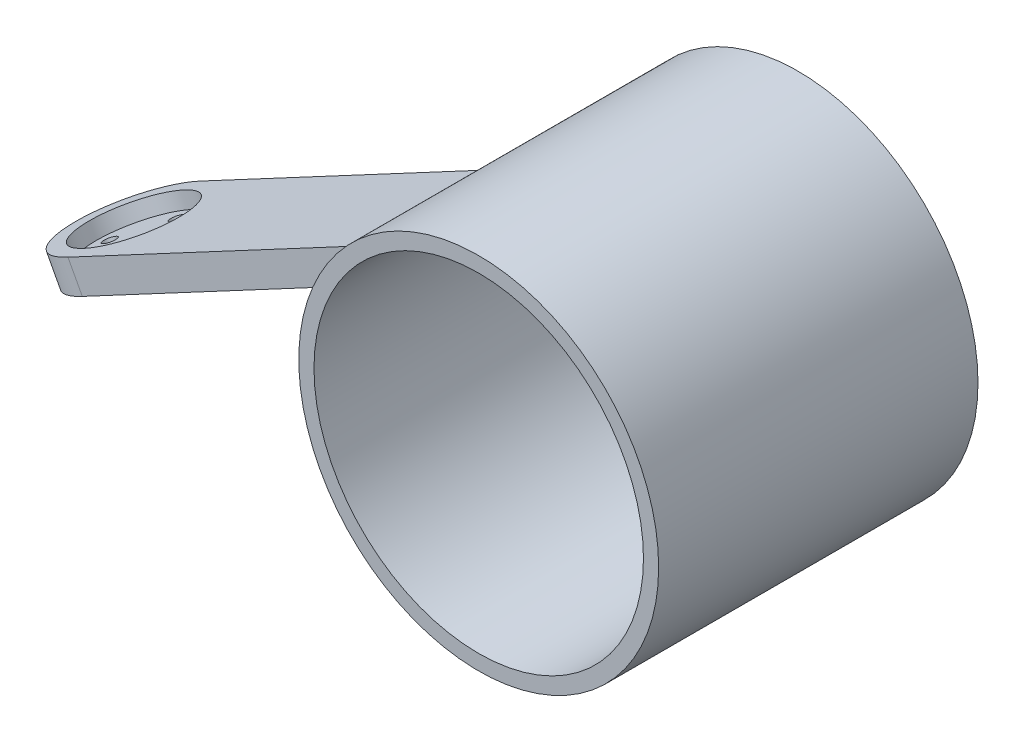
ISO-10303-21;
HEADER;
FILE_DESCRIPTION(('STEP AP214'),'2;1');
FILE_NAME('part.step','',(''),(''),'','','');
FILE_SCHEMA(('AUTOMOTIVE_DESIGN { 1 0 10303 214 1 1 1 1 }'));
ENDSEC;
DATA;
#1=APPLICATION_CONTEXT('core data for automotive mechanical design processes');
#2=APPLICATION_PROTOCOL_DEFINITION('international standard','automotive_design',2000,#1);
#3=PRODUCT_CONTEXT('',#1,'mechanical');
#4=PRODUCT('Part','Part','',(#3));
#5=PRODUCT_RELATED_PRODUCT_CATEGORY('part','',(#4));
#6=PRODUCT_DEFINITION_FORMATION('','',#4);
#7=PRODUCT_DEFINITION_CONTEXT('part definition',#1,'design');
#8=PRODUCT_DEFINITION('design','',#6,#7);
#9=PRODUCT_DEFINITION_SHAPE('','',#8);
#10=(LENGTH_UNIT() NAMED_UNIT(*) SI_UNIT(.MILLI.,.METRE.));
#11=(NAMED_UNIT(*) PLANE_ANGLE_UNIT() SI_UNIT($,.RADIAN.));
#12=(NAMED_UNIT(*) SI_UNIT($,.STERADIAN.) SOLID_ANGLE_UNIT());
#13=UNCERTAINTY_MEASURE_WITH_UNIT(LENGTH_MEASURE(1.E-05),#10,'distance_accuracy_value','');
#14=(GEOMETRIC_REPRESENTATION_CONTEXT(3) GLOBAL_UNCERTAINTY_ASSIGNED_CONTEXT((#13)) GLOBAL_UNIT_ASSIGNED_CONTEXT((#10,
#11,#12)) REPRESENTATION_CONTEXT('',''));
#15=CARTESIAN_POINT('',(0.,0.,0.));
#16=DIRECTION('',(0.,0.,1.));
#17=DIRECTION('',(1.,0.,0.));
#18=AXIS2_PLACEMENT_3D('',#15,#16,#17);
#19=CARTESIAN_POINT('',(0.,0.,63.));
#20=DIRECTION('',(0.,0.,-1.));
#21=DIRECTION('',(-1.,0.,0.));
#22=AXIS2_PLACEMENT_3D('',#19,#20,#21);
#23=CYLINDRICAL_SURFACE('',#22,35.5);
#24=CARTESIAN_POINT('',(0.,0.,0.));
#25=DIRECTION('',(0.,0.,1.));
#26=DIRECTION('',(1.,0.,0.));
#27=AXIS2_PLACEMENT_3D('',#24,#25,#26);
#28=CIRCLE('',#27,35.5);
#29=CARTESIAN_POINT('',(35.5,0.,0.));
#30=VERTEX_POINT('',#29);
#31=EDGE_CURVE('E40',#30,#30,#28,.T.);
#32=ORIENTED_EDGE('',*,*,#31,.T.);
#33=EDGE_LOOP('',(#32));
#34=FACE_BOUND('',#33,.T.);
#35=CARTESIAN_POINT('',(0.,0.,63.));
#36=DIRECTION('',(0.,0.,1.));
#37=DIRECTION('',(1.,0.,0.));
#38=AXIS2_PLACEMENT_3D('',#35,#36,#37);
#39=CIRCLE('',#38,35.5);
#40=CARTESIAN_POINT('',(35.5,0.,63.));
#41=VERTEX_POINT('',#40);
#42=EDGE_CURVE('E11',#41,#41,#39,.T.);
#43=ORIENTED_EDGE('',*,*,#42,.F.);
#44=EDGE_LOOP('',(#43));
#45=FACE_BOUND('',#44,.T.);
#46=CARTESIAN_POINT('',(0.,0.,15.1719581378899));
#47=DIRECTION('',(0.,0.,-1.));
#48=DIRECTION('',(1.,0.,0.));
#49=AXIS2_PLACEMENT_3D('',#46,#47,#48);
#50=CIRCLE('',#49,35.5);
#51=CARTESIAN_POINT('',(-35.4419700421451,2.02897992392495,15.1719581378899));
#52=VERTEX_POINT('',#51);
#53=CARTESIAN_POINT('',(-34.2089351013572,9.48676758601868,15.1719581378899));
#54=VERTEX_POINT('',#53);
#55=EDGE_CURVE('E56',#52,#54,#50,.T.);
#56=ORIENTED_EDGE('',*,*,#55,.T.);
#57=DIRECTION('',(0.,0.,1.));
#58=VECTOR('',#57,1.);
#59=CARTESIAN_POINT('',(-34.2089351013572,9.48676758601868,15.1719581378899));
#60=LINE('',#59,#58);
#61=CARTESIAN_POINT('',(-34.2089351013572,9.48676758601868,41.1719581378899));
#62=VERTEX_POINT('',#61);
#63=EDGE_CURVE('E93',#54,#62,#60,.T.);
#64=ORIENTED_EDGE('',*,*,#63,.T.);
#65=CARTESIAN_POINT('',(0.,0.,41.1719581378899));
#66=DIRECTION('',(0.,0.,-1.));
#67=DIRECTION('',(1.,0.,0.));
#68=AXIS2_PLACEMENT_3D('',#65,#66,#67);
#69=CIRCLE('',#68,35.5);
#70=CARTESIAN_POINT('',(-35.4419700421451,2.02897992392495,41.1719581378899));
#71=VERTEX_POINT('',#70);
#72=EDGE_CURVE('E131',#71,#62,#69,.T.);
#73=ORIENTED_EDGE('',*,*,#72,.F.);
#74=DIRECTION('',(0.,0.,1.));
#75=VECTOR('',#74,1.);
#76=CARTESIAN_POINT('',(-35.4419700421451,2.02897992392495,15.1719581378899));
#77=LINE('',#76,#75);
#78=EDGE_CURVE('E96',#52,#71,#77,.T.);
#79=ORIENTED_EDGE('',*,*,#78,.F.);
#80=EDGE_LOOP('',(#56,#64,#73,#79));
#81=FACE_BOUND('',#80,.T.);
#82=ADVANCED_FACE('F32',(#34,#45,#81),#23,.T.);
#83=CARTESIAN_POINT('',(0.,0.,63.));
#84=DIRECTION('',(0.,0.,-1.));
#85=DIRECTION('',(-1.,0.,0.));
#86=AXIS2_PLACEMENT_3D('',#83,#84,#85);
#87=CYLINDRICAL_SURFACE('',#86,32.5);
#88=CARTESIAN_POINT('',(0.,0.,63.));
#89=DIRECTION('',(0.,0.,1.));
#90=DIRECTION('',(1.,0.,0.));
#91=AXIS2_PLACEMENT_3D('',#88,#89,#90);
#92=CIRCLE('',#91,32.5);
#93=CARTESIAN_POINT('',(32.5,0.,63.));
#94=VERTEX_POINT('',#93);
#95=EDGE_CURVE('E104',#94,#94,#92,.T.);
#96=ORIENTED_EDGE('',*,*,#95,.T.);
#97=EDGE_LOOP('',(#96));
#98=FACE_BOUND('',#97,.T.);
#99=CARTESIAN_POINT('',(0.,0.,3.));
#100=DIRECTION('',(0.,0.,-1.));
#101=DIRECTION('',(-1.,0.,0.));
#102=AXIS2_PLACEMENT_3D('',#99,#100,#101);
#103=CIRCLE('',#102,32.5);
#104=CARTESIAN_POINT('',(-32.5,0.,3.));
#105=VERTEX_POINT('',#104);
#106=EDGE_CURVE('E100',#105,#105,#103,.T.);
#107=ORIENTED_EDGE('',*,*,#106,.T.);
#108=EDGE_LOOP('',(#107));
#109=FACE_BOUND('',#108,.T.);
#110=ADVANCED_FACE('F155',(#98,#109),#87,.F.);
#111=CARTESIAN_POINT('',(0.,0.,63.));
#112=DIRECTION('',(0.,0.,1.));
#113=DIRECTION('',(1.,0.,0.));
#114=AXIS2_PLACEMENT_3D('',#111,#112,#113);
#115=PLANE('',#114);
#116=ORIENTED_EDGE('',*,*,#42,.T.);
#117=EDGE_LOOP('',(#116));
#118=FACE_BOUND('',#117,.T.);
#119=ORIENTED_EDGE('',*,*,#95,.F.);
#120=EDGE_LOOP('',(#119));
#121=FACE_BOUND('',#120,.T.);
#122=ADVANCED_FACE('F160',(#118,#121),#115,.T.);
#123=CARTESIAN_POINT('',(0.,0.,0.));
#124=DIRECTION('',(0.,0.,1.));
#125=DIRECTION('',(1.,0.,0.));
#126=AXIS2_PLACEMENT_3D('',#123,#124,#125);
#127=PLANE('',#126);
#128=ORIENTED_EDGE('',*,*,#31,.F.);
#129=EDGE_LOOP('',(#128));
#130=FACE_BOUND('',#129,.T.);
#131=ADVANCED_FACE('F169',(#130),#127,.F.);
#132=CARTESIAN_POINT('',(0.,0.,3.));
#133=DIRECTION('',(0.,0.,-1.));
#134=DIRECTION('',(-1.,0.,0.));
#135=AXIS2_PLACEMENT_3D('',#132,#133,#134);
#136=PLANE('',#135);
#137=ORIENTED_EDGE('',*,*,#106,.F.);
#138=EDGE_LOOP('',(#137));
#139=FACE_BOUND('',#138,.T.);
#140=ADVANCED_FACE('F175',(#139),#136,.F.);
#141=CARTESIAN_POINT('',(-35.4419700421451,2.02897992392495,15.1719581378899));
#142=DIRECTION('',(0.470616857577724,-0.882337675362255,0.));
#143=DIRECTION('',(0.882337675362255,0.470616857577724,0.));
#144=AXIS2_PLACEMENT_3D('',#141,#142,#143);
#145=PLANE('',#144);
#146=CARTESIAN_POINT('',(-100.033619174806,-32.4225909308432,35.1719581381118));
#147=DIRECTION('',(0.470616857577712,-0.882337675362262,0.));
#148=DIRECTION('',(0.882337675362262,0.470616857577712,0.));
#149=AXIS2_PLACEMENT_3D('',#146,#147,#148);
#150=CIRCLE('',#149,1.27499999999999);
#151=CARTESIAN_POINT('',(-98.9086386387187,-31.8225544374317,35.1719581381118));
#152=VERTEX_POINT('',#151);
#153=EDGE_CURVE('E113',#152,#152,#150,.T.);
#154=ORIENTED_EDGE('',*,*,#153,.F.);
#155=EDGE_LOOP('',(#154));
#156=FACE_BOUND('',#155,.T.);
#157=CARTESIAN_POINT('',(-106.209982902341,-35.7169089338872,28.1719581381118));
#158=DIRECTION('',(0.470616857577712,-0.882337675362262,0.));
#159=DIRECTION('',(0.882337675362262,0.470616857577712,0.));
#160=AXIS2_PLACEMENT_3D('',#157,#158,#159);
#161=CIRCLE('',#160,1.275);
#162=CARTESIAN_POINT('',(-105.085002366255,-35.1168724404757,28.1719581381118));
#163=VERTEX_POINT('',#162);
#164=EDGE_CURVE('E280',#163,#163,#161,.T.);
#165=ORIENTED_EDGE('',*,*,#164,.F.);
#166=EDGE_LOOP('',(#165));
#167=FACE_BOUND('',#166,.T.);
#168=CARTESIAN_POINT('',(-100.033619174806,-32.4225909308432,21.1719581381118));
#169=DIRECTION('',(0.470616857577712,-0.882337675362262,0.));
#170=DIRECTION('',(-0.882337675362262,-0.470616857577712,0.));
#171=AXIS2_PLACEMENT_3D('',#168,#169,#170);
#172=CIRCLE('',#171,1.27499999999999);
#173=CARTESIAN_POINT('',(-101.158599710892,-33.0226274242548,21.1719581381118));
#174=VERTEX_POINT('',#173);
#175=EDGE_CURVE('E277',#174,#174,#172,.T.);
#176=ORIENTED_EDGE('',*,*,#175,.F.);
#177=EDGE_LOOP('',(#176));
#178=FACE_BOUND('',#177,.T.);
#179=CARTESIAN_POINT('',(-93.8572554472698,-29.1282729277993,28.1719581381118));
#180=DIRECTION('',(0.470616857577712,-0.882337675362262,0.));
#181=DIRECTION('',(-0.882337675362262,-0.470616857577712,0.));
#182=AXIS2_PLACEMENT_3D('',#179,#180,#181);
#183=CIRCLE('',#182,1.275);
#184=CARTESIAN_POINT('',(-94.9822359833566,-29.7283094212109,28.1719581381118));
#185=VERTEX_POINT('',#184);
#186=EDGE_CURVE('E274',#185,#185,#183,.T.);
#187=ORIENTED_EDGE('',*,*,#186,.F.);
#188=EDGE_LOOP('',(#187));
#189=FACE_BOUND('',#188,.T.);
#190=DIRECTION('',(0.882337675362255,0.470616857577724,0.));
#191=VECTOR('',#190,1.);
#192=CARTESIAN_POINT('',(-35.4419700421451,2.02897992392495,41.1719581378899));
#193=LINE('',#192,#191);
#194=CARTESIAN_POINT('',(-100.033619174801,-32.4225909308425,41.1719581378899));
#195=VERTEX_POINT('',#194);
#196=EDGE_CURVE('E48',#195,#71,#193,.T.);
#197=ORIENTED_EDGE('',*,*,#196,.F.);
#198=CARTESIAN_POINT('',(-100.033619174806,-32.4225909308433,28.1719581381118));
#199=DIRECTION('',(0.470616857577712,-0.882337675362262,0.));
#200=DIRECTION('',(0.882337675362262,0.470616857577712,0.));
#201=AXIS2_PLACEMENT_3D('',#198,#199,#200);
#202=CIRCLE('',#201,13.);
#203=CARTESIAN_POINT('',(-100.033619174806,-32.4225909308433,15.1719581378899));
#204=VERTEX_POINT('',#203);
#205=EDGE_CURVE('E80',#195,#204,#202,.T.);
#206=ORIENTED_EDGE('',*,*,#205,.T.);
#207=DIRECTION('',(0.882337675362255,0.470616857577724,0.));
#208=VECTOR('',#207,1.);
#209=CARTESIAN_POINT('',(-35.4419700421451,2.02897992392495,15.1719581378899));
#210=LINE('',#209,#208);
#211=EDGE_CURVE('E84',#204,#52,#210,.T.);
#212=ORIENTED_EDGE('',*,*,#211,.T.);
#213=ORIENTED_EDGE('',*,*,#78,.T.);
#214=EDGE_LOOP('',(#197,#206,#212,#213));
#215=FACE_BOUND('',#214,.T.);
#216=ADVANCED_FACE('F88',(#156,#167,#178,#189,#215),#145,.T.);
#217=CARTESIAN_POINT('',(-34.2089351013572,9.48676758601868,15.1719581378899));
#218=DIRECTION('',(-0.470616857577723,0.882337675362256,0.));
#219=DIRECTION('',(-0.882337675362256,-0.470616857577723,0.));
#220=AXIS2_PLACEMENT_3D('',#217,#218,#219);
#221=PLANE('',#220);
#222=CARTESIAN_POINT('',(-102.857320320272,-27.1285648786698,28.1719581381118));
#223=DIRECTION('',(-0.470616857577712,0.882337675362262,0.));
#224=DIRECTION('',(-0.882337675362262,-0.470616857577712,0.));
#225=AXIS2_PLACEMENT_3D('',#222,#223,#224);
#226=CIRCLE('',#225,9.99999999999999);
#227=CARTESIAN_POINT('',(-111.680697073895,-31.8347334544469,28.1719581381118));
#228=VERTEX_POINT('',#227);
#229=EDGE_CURVE('E120',#228,#228,#226,.T.);
#230=ORIENTED_EDGE('',*,*,#229,.F.);
#231=EDGE_LOOP('',(#230));
#232=FACE_BOUND('',#231,.T.);
#233=DIRECTION('',(-0.882337675362256,-0.470616857577723,0.));
#234=VECTOR('',#233,1.);
#235=CARTESIAN_POINT('',(-34.2089351013572,9.48676758601868,15.1719581378899));
#236=LINE('',#235,#234);
#237=CARTESIAN_POINT('',(-102.857320320272,-27.1285648786697,15.1719581378899));
#238=VERTEX_POINT('',#237);
#239=EDGE_CURVE('E85',#54,#238,#236,.T.);
#240=ORIENTED_EDGE('',*,*,#239,.T.);
#241=CARTESIAN_POINT('',(-102.857320320272,-27.1285648786697,28.1719581381118));
#242=DIRECTION('',(0.470616857577712,-0.882337675362262,0.));
#243=DIRECTION('',(0.882337675362262,0.470616857577712,0.));
#244=AXIS2_PLACEMENT_3D('',#241,#242,#243);
#245=CIRCLE('',#244,13.);
#246=CARTESIAN_POINT('',(-102.857320320272,-27.1285648786697,41.1719581378899));
#247=VERTEX_POINT('',#246);
#248=EDGE_CURVE('E82',#247,#238,#245,.T.);
#249=ORIENTED_EDGE('',*,*,#248,.F.);
#250=DIRECTION('',(-0.882337675362256,-0.470616857577723,0.));
#251=VECTOR('',#250,1.);
#252=CARTESIAN_POINT('',(-34.2089351013572,9.48676758601868,41.1719581378899));
#253=LINE('',#252,#251);
#254=EDGE_CURVE('E134',#62,#247,#253,.T.);
#255=ORIENTED_EDGE('',*,*,#254,.F.);
#256=ORIENTED_EDGE('',*,*,#63,.F.);
#257=EDGE_LOOP('',(#240,#249,#255,#256));
#258=FACE_BOUND('',#257,.T.);
#259=ADVANCED_FACE('F141',(#232,#258),#221,.T.);
#260=CARTESIAN_POINT('',(0.,0.,15.1719581378899));
#261=DIRECTION('',(0.,0.,1.));
#262=DIRECTION('',(1.,0.,0.));
#263=AXIS2_PLACEMENT_3D('',#260,#261,#262);
#264=PLANE('',#263);
#265=ORIENTED_EDGE('',*,*,#55,.F.);
#266=ORIENTED_EDGE('',*,*,#211,.F.);
#267=DIRECTION('',(0.470616857577723,-0.882337675362255,0.));
#268=VECTOR('',#267,1.);
#269=CARTESIAN_POINT('',(-102.857320320268,-27.1285648786689,15.1719581378899));
#270=LINE('',#269,#268);
#271=EDGE_CURVE('E77',#238,#204,#270,.T.);
#272=ORIENTED_EDGE('',*,*,#271,.F.);
#273=ORIENTED_EDGE('',*,*,#239,.F.);
#274=EDGE_LOOP('',(#265,#266,#272,#273));
#275=FACE_BOUND('',#274,.T.);
#276=ADVANCED_FACE('F92',(#275),#264,.F.);
#277=CARTESIAN_POINT('',(0.,0.,41.1719581378899));
#278=DIRECTION('',(0.,0.,1.));
#279=DIRECTION('',(1.,0.,0.));
#280=AXIS2_PLACEMENT_3D('',#277,#278,#279);
#281=PLANE('',#280);
#282=ORIENTED_EDGE('',*,*,#72,.T.);
#283=ORIENTED_EDGE('',*,*,#254,.T.);
#284=DIRECTION('',(0.470616857577723,-0.882337675362255,0.));
#285=VECTOR('',#284,1.);
#286=CARTESIAN_POINT('',(-102.857320320268,-27.1285648786689,41.1719581378899));
#287=LINE('',#286,#285);
#288=EDGE_CURVE('E137',#247,#195,#287,.T.);
#289=ORIENTED_EDGE('',*,*,#288,.T.);
#290=ORIENTED_EDGE('',*,*,#196,.T.);
#291=EDGE_LOOP('',(#282,#283,#289,#290));
#292=FACE_BOUND('',#291,.T.);
#293=ADVANCED_FACE('F144',(#292),#281,.T.);
#294=CARTESIAN_POINT('',(-102.857320320272,-27.1285648786697,28.1719581381118));
#295=DIRECTION('',(0.470616857577712,-0.882337675362261,0.));
#296=DIRECTION('',(0.882337675362262,0.470616857577712,0.));
#297=AXIS2_PLACEMENT_3D('',#294,#295,#296);
#298=CYLINDRICAL_SURFACE('',#297,13.);
#299=ORIENTED_EDGE('',*,*,#248,.T.);
#300=ORIENTED_EDGE('',*,*,#271,.T.);
#301=ORIENTED_EDGE('',*,*,#205,.F.);
#302=ORIENTED_EDGE('',*,*,#288,.F.);
#303=EDGE_LOOP('',(#299,#300,#301,#302));
#304=FACE_BOUND('',#303,.T.);
#305=ADVANCED_FACE('F79',(#304),#298,.T.);
#306=CARTESIAN_POINT('',(-101.445469747539,-29.7755779047566,28.1719581381118));
#307=DIRECTION('',(-0.470616857577712,0.882337675362261,0.));
#308=DIRECTION('',(-0.882337675362262,-0.470616857577712,0.));
#309=AXIS2_PLACEMENT_3D('',#306,#307,#308);
#310=CYLINDRICAL_SURFACE('',#309,9.99999999999999);
#311=CARTESIAN_POINT('',(-101.445469747539,-29.7755779047566,28.1719581381118));
#312=DIRECTION('',(-0.470616857577712,0.882337675362262,0.));
#313=DIRECTION('',(-0.882337675362262,-0.470616857577712,0.));
#314=AXIS2_PLACEMENT_3D('',#311,#312,#313);
#315=CIRCLE('',#314,9.99999999999999);
#316=CARTESIAN_POINT('',(-110.268846501161,-34.4817464805337,28.1719581381118));
#317=VERTEX_POINT('',#316);
#318=EDGE_CURVE('E90',#317,#317,#315,.T.);
#319=ORIENTED_EDGE('',*,*,#318,.F.);
#320=EDGE_LOOP('',(#319));
#321=FACE_BOUND('',#320,.T.);
#322=ORIENTED_EDGE('',*,*,#229,.T.);
#323=EDGE_LOOP('',(#322));
#324=FACE_BOUND('',#323,.T.);
#325=ADVANCED_FACE('F151',(#321,#324),#310,.F.);
#326=CARTESIAN_POINT('',(-101.445469747539,-29.7755779047566,28.1719581381118));
#327=DIRECTION('',(-0.470616857577712,0.882337675362262,0.));
#328=DIRECTION('',(-0.882337675362262,-0.470616857577712,0.));
#329=AXIS2_PLACEMENT_3D('',#326,#327,#328);
#330=PLANE('',#329);
#331=CARTESIAN_POINT('',(-101.445469747539,-29.7755779047565,35.1719581381118));
#332=DIRECTION('',(-0.470616857577712,0.882337675362262,0.));
#333=DIRECTION('',(-0.882337675362262,-0.470616857577712,0.));
#334=AXIS2_PLACEMENT_3D('',#331,#332,#333);
#335=CIRCLE('',#334,1.27499999999999);
#336=CARTESIAN_POINT('',(-102.570450283626,-30.3756143981681,35.1719581381118));
#337=VERTEX_POINT('',#336);
#338=EDGE_CURVE('E35',#337,#337,#335,.T.);
#339=ORIENTED_EDGE('',*,*,#338,.F.);
#340=EDGE_LOOP('',(#339));
#341=FACE_BOUND('',#340,.T.);
#342=CARTESIAN_POINT('',(-107.621833475075,-33.0698959078005,28.1719581381118));
#343=DIRECTION('',(-0.470616857577712,0.882337675362262,0.));
#344=DIRECTION('',(-0.882337675362262,-0.470616857577712,0.));
#345=AXIS2_PLACEMENT_3D('',#342,#343,#344);
#346=CIRCLE('',#345,1.275);
#347=CARTESIAN_POINT('',(-108.746814011161,-33.6699324012121,28.1719581381118));
#348=VERTEX_POINT('',#347);
#349=EDGE_CURVE('E115',#348,#348,#346,.T.);
#350=ORIENTED_EDGE('',*,*,#349,.F.);
#351=EDGE_LOOP('',(#350));
#352=FACE_BOUND('',#351,.T.);
#353=CARTESIAN_POINT('',(-101.445469747539,-29.7755779047565,21.1719581381118));
#354=DIRECTION('',(-0.470616857577712,0.882337675362262,0.));
#355=DIRECTION('',(-0.882337675362262,-0.470616857577712,0.));
#356=AXIS2_PLACEMENT_3D('',#353,#354,#355);
#357=CIRCLE('',#356,1.27499999999999);
#358=CARTESIAN_POINT('',(-102.570450283626,-30.3756143981681,21.1719581381118));
#359=VERTEX_POINT('',#358);
#360=EDGE_CURVE('E112',#359,#359,#357,.T.);
#361=ORIENTED_EDGE('',*,*,#360,.F.);
#362=EDGE_LOOP('',(#361));
#363=FACE_BOUND('',#362,.T.);
#364=CARTESIAN_POINT('',(-95.2691060200029,-26.4812599017126,28.1719581381118));
#365=DIRECTION('',(-0.470616857577712,0.882337675362262,0.));
#366=DIRECTION('',(-0.882337675362262,-0.470616857577712,0.));
#367=AXIS2_PLACEMENT_3D('',#364,#365,#366);
#368=CIRCLE('',#367,1.275);
#369=CARTESIAN_POINT('',(-96.3940865560897,-27.0812963951241,28.1719581381118));
#370=VERTEX_POINT('',#369);
#371=EDGE_CURVE('E109',#370,#370,#368,.T.);
#372=ORIENTED_EDGE('',*,*,#371,.F.);
#373=EDGE_LOOP('',(#372));
#374=FACE_BOUND('',#373,.T.);
#375=ORIENTED_EDGE('',*,*,#318,.T.);
#376=EDGE_LOOP('',(#375));
#377=FACE_BOUND('',#376,.T.);
#378=ADVANCED_FACE('F219',(#341,#352,#363,#374,#377),#330,.T.);
#379=CARTESIAN_POINT('',(-125.227493290961,29.6863281407416,28.1719581381118));
#380=DIRECTION('',(0.470616857577712,-0.882337675362262,0.));
#381=DIRECTION('',(0.882337675362261,0.470616857577712,0.));
#382=AXIS2_PLACEMENT_3D('',#379,#380,#381);
#383=CYLINDRICAL_SURFACE('',#382,1.275);
#384=ORIENTED_EDGE('',*,*,#371,.T.);
#385=EDGE_LOOP('',(#384));
#386=FACE_BOUND('',#385,.T.);
#387=ORIENTED_EDGE('',*,*,#186,.T.);
#388=EDGE_LOOP('',(#387));
#389=FACE_BOUND('',#388,.T.);
#390=ADVANCED_FACE('F226',(#386,#389),#383,.F.);
#391=CARTESIAN_POINT('',(-131.403857018496,26.3920101376976,21.1719581381118));
#392=DIRECTION('',(0.470616857577712,-0.882337675362262,0.));
#393=DIRECTION('',(0.882337675362261,0.470616857577712,0.));
#394=AXIS2_PLACEMENT_3D('',#391,#392,#393);
#395=CYLINDRICAL_SURFACE('',#394,1.27499999999999);
#396=ORIENTED_EDGE('',*,*,#360,.T.);
#397=EDGE_LOOP('',(#396));
#398=FACE_BOUND('',#397,.T.);
#399=ORIENTED_EDGE('',*,*,#175,.T.);
#400=EDGE_LOOP('',(#399));
#401=FACE_BOUND('',#400,.T.);
#402=ADVANCED_FACE('F234',(#398,#401),#395,.F.);
#403=CARTESIAN_POINT('',(-137.580220746032,23.0976921346536,28.1719581381118));
#404=DIRECTION('',(0.470616857577712,-0.882337675362262,0.));
#405=DIRECTION('',(0.882337675362261,0.470616857577712,0.));
#406=AXIS2_PLACEMENT_3D('',#403,#404,#405);
#407=CYLINDRICAL_SURFACE('',#406,1.275);
#408=ORIENTED_EDGE('',*,*,#349,.T.);
#409=EDGE_LOOP('',(#408));
#410=FACE_BOUND('',#409,.T.);
#411=ORIENTED_EDGE('',*,*,#164,.T.);
#412=EDGE_LOOP('',(#411));
#413=FACE_BOUND('',#412,.T.);
#414=ADVANCED_FACE('F242',(#410,#413),#407,.F.);
#415=CARTESIAN_POINT('',(-131.403857018496,26.3920101376976,35.1719581381118));
#416=DIRECTION('',(0.470616857577712,-0.882337675362262,0.));
#417=DIRECTION('',(0.882337675362261,0.470616857577712,0.));
#418=AXIS2_PLACEMENT_3D('',#415,#416,#417);
#419=CYLINDRICAL_SURFACE('',#418,1.27499999999999);
#420=ORIENTED_EDGE('',*,*,#338,.T.);
#421=EDGE_LOOP('',(#420));
#422=FACE_BOUND('',#421,.T.);
#423=ORIENTED_EDGE('',*,*,#153,.T.);
#424=EDGE_LOOP('',(#423));
#425=FACE_BOUND('',#424,.T.);
#426=ADVANCED_FACE('F250',(#422,#425),#419,.F.);
#427=CLOSED_SHELL('',(#82,#110,#122,#131,#140,#216,#259,#276,#293,#305,#325,#378,#390,#402,#414,#426));
#428=MANIFOLD_SOLID_BREP('B2',#427);
#429=ADVANCED_BREP_SHAPE_REPRESENTATION('',(#18,#428),#14);
#430=SHAPE_DEFINITION_REPRESENTATION(#9,#429);
ENDSEC;
END-ISO-10303-21;
